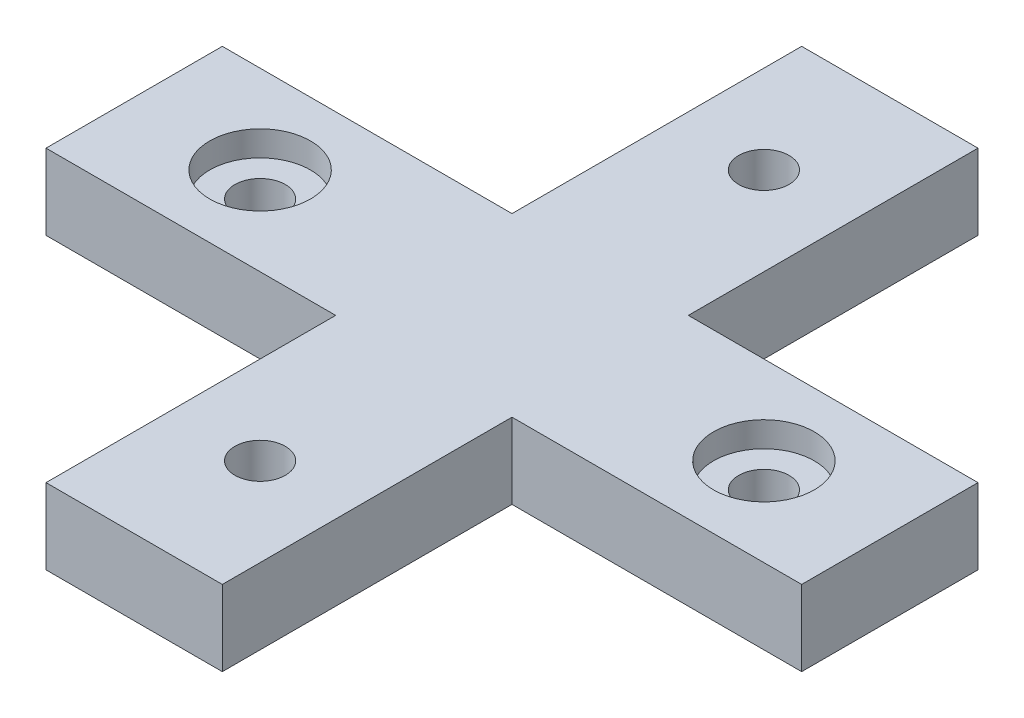
ISO-10303-21;
HEADER;
FILE_DESCRIPTION(('STEP AP214'),'2;1');
FILE_NAME('part.step','',(''),(''),'','','');
FILE_SCHEMA(('AUTOMOTIVE_DESIGN { 1 0 10303 214 1 1 1 1 }'));
ENDSEC;
DATA;
#1=APPLICATION_CONTEXT('core data for automotive mechanical design processes');
#2=APPLICATION_PROTOCOL_DEFINITION('international standard','automotive_design',2000,#1);
#3=PRODUCT_CONTEXT('',#1,'mechanical');
#4=PRODUCT('Part','Part','',(#3));
#5=PRODUCT_RELATED_PRODUCT_CATEGORY('part','',(#4));
#6=PRODUCT_DEFINITION_FORMATION('','',#4);
#7=PRODUCT_DEFINITION_CONTEXT('part definition',#1,'design');
#8=PRODUCT_DEFINITION('design','',#6,#7);
#9=PRODUCT_DEFINITION_SHAPE('','',#8);
#10=(LENGTH_UNIT() NAMED_UNIT(*) SI_UNIT(.MILLI.,.METRE.));
#11=(NAMED_UNIT(*) PLANE_ANGLE_UNIT() SI_UNIT($,.RADIAN.));
#12=(NAMED_UNIT(*) SI_UNIT($,.STERADIAN.) SOLID_ANGLE_UNIT());
#13=UNCERTAINTY_MEASURE_WITH_UNIT(LENGTH_MEASURE(1.E-05),#10,'distance_accuracy_value','');
#14=(GEOMETRIC_REPRESENTATION_CONTEXT(3) GLOBAL_UNCERTAINTY_ASSIGNED_CONTEXT((#13)) GLOBAL_UNIT_ASSIGNED_CONTEXT((#10,
#11,#12)) REPRESENTATION_CONTEXT('',''));
#15=CARTESIAN_POINT('',(0.,0.,0.));
#16=DIRECTION('',(0.,0.,1.));
#17=DIRECTION('',(1.,0.,0.));
#18=AXIS2_PLACEMENT_3D('',#15,#16,#17);
#19=CARTESIAN_POINT('',(0.,3.,3.5));
#20=DIRECTION('',(0.,0.,-1.));
#21=DIRECTION('',(-1.,0.,0.));
#22=AXIS2_PLACEMENT_3D('',#19,#20,#21);
#23=PLANE('',#22);
#24=DIRECTION('',(1.,0.,0.));
#25=VECTOR('',#24,1.);
#26=CARTESIAN_POINT('',(0.,0.,3.5));
#27=LINE('',#26,#25);
#28=CARTESIAN_POINT('',(-15.,0.,3.5));
#29=VERTEX_POINT('',#28);
#30=CARTESIAN_POINT('',(-3.5,0.,3.5));
#31=VERTEX_POINT('',#30);
#32=EDGE_CURVE('E164',#29,#31,#27,.T.);
#33=ORIENTED_EDGE('',*,*,#32,.T.);
#34=DIRECTION('',(0.,-1.,0.));
#35=VECTOR('',#34,1.);
#36=CARTESIAN_POINT('',(-3.5,3.,3.5));
#37=LINE('',#36,#35);
#38=CARTESIAN_POINT('',(-3.5,3.,3.5));
#39=VERTEX_POINT('',#38);
#40=EDGE_CURVE('E220',#39,#31,#37,.T.);
#41=ORIENTED_EDGE('',*,*,#40,.F.);
#42=DIRECTION('',(1.,0.,0.));
#43=VECTOR('',#42,1.);
#44=CARTESIAN_POINT('',(0.,3.,3.5));
#45=LINE('',#44,#43);
#46=CARTESIAN_POINT('',(-15.,3.,3.5));
#47=VERTEX_POINT('',#46);
#48=EDGE_CURVE('E233',#47,#39,#45,.T.);
#49=ORIENTED_EDGE('',*,*,#48,.F.);
#50=DIRECTION('',(0.,-1.,0.));
#51=VECTOR('',#50,1.);
#52=CARTESIAN_POINT('',(-15.,3.,3.5));
#53=LINE('',#52,#51);
#54=EDGE_CURVE('E163',#47,#29,#53,.T.);
#55=ORIENTED_EDGE('',*,*,#54,.T.);
#56=EDGE_LOOP('',(#33,#41,#49,#55));
#57=FACE_BOUND('',#56,.T.);
#58=ADVANCED_FACE('F33',(#57),#23,.F.);
#59=CARTESIAN_POINT('',(-3.5,3.,0.));
#60=DIRECTION('',(1.,0.,0.));
#61=DIRECTION('',(0.,0.,-1.));
#62=AXIS2_PLACEMENT_3D('',#59,#60,#61);
#63=PLANE('',#62);
#64=DIRECTION('',(0.,0.,1.));
#65=VECTOR('',#64,1.);
#66=CARTESIAN_POINT('',(-3.5,0.,0.));
#67=LINE('',#66,#65);
#68=CARTESIAN_POINT('',(-3.5,0.,15.));
#69=VERTEX_POINT('',#68);
#70=EDGE_CURVE('E167',#31,#69,#67,.T.);
#71=ORIENTED_EDGE('',*,*,#70,.T.);
#72=DIRECTION('',(0.,-1.,0.));
#73=VECTOR('',#72,1.);
#74=CARTESIAN_POINT('',(-3.5,3.,15.));
#75=LINE('',#74,#73);
#76=CARTESIAN_POINT('',(-3.5,3.,15.));
#77=VERTEX_POINT('',#76);
#78=EDGE_CURVE('E217',#77,#69,#75,.T.);
#79=ORIENTED_EDGE('',*,*,#78,.F.);
#80=DIRECTION('',(0.,0.,1.));
#81=VECTOR('',#80,1.);
#82=CARTESIAN_POINT('',(-3.5,3.,0.));
#83=LINE('',#82,#81);
#84=EDGE_CURVE('E102',#39,#77,#83,.T.);
#85=ORIENTED_EDGE('',*,*,#84,.F.);
#86=ORIENTED_EDGE('',*,*,#40,.T.);
#87=EDGE_LOOP('',(#71,#79,#85,#86));
#88=FACE_BOUND('',#87,.T.);
#89=ADVANCED_FACE('F279',(#88),#63,.F.);
#90=CARTESIAN_POINT('',(0.,3.,15.));
#91=DIRECTION('',(0.,0.,-1.));
#92=DIRECTION('',(-1.,0.,0.));
#93=AXIS2_PLACEMENT_3D('',#90,#91,#92);
#94=PLANE('',#93);
#95=DIRECTION('',(1.,0.,0.));
#96=VECTOR('',#95,1.);
#97=CARTESIAN_POINT('',(0.,0.,15.));
#98=LINE('',#97,#96);
#99=CARTESIAN_POINT('',(3.5,0.,15.));
#100=VERTEX_POINT('',#99);
#101=EDGE_CURVE('E170',#69,#100,#98,.T.);
#102=ORIENTED_EDGE('',*,*,#101,.T.);
#103=DIRECTION('',(0.,-1.,0.));
#104=VECTOR('',#103,1.);
#105=CARTESIAN_POINT('',(3.5,3.,15.));
#106=LINE('',#105,#104);
#107=CARTESIAN_POINT('',(3.5,3.,15.));
#108=VERTEX_POINT('',#107);
#109=EDGE_CURVE('E215',#108,#100,#106,.T.);
#110=ORIENTED_EDGE('',*,*,#109,.F.);
#111=DIRECTION('',(1.,0.,0.));
#112=VECTOR('',#111,1.);
#113=CARTESIAN_POINT('',(0.,3.,15.));
#114=LINE('',#113,#112);
#115=EDGE_CURVE('E241',#77,#108,#114,.T.);
#116=ORIENTED_EDGE('',*,*,#115,.F.);
#117=ORIENTED_EDGE('',*,*,#78,.T.);
#118=EDGE_LOOP('',(#102,#110,#116,#117));
#119=FACE_BOUND('',#118,.T.);
#120=ADVANCED_FACE('F283',(#119),#94,.F.);
#121=CARTESIAN_POINT('',(3.5,3.,0.));
#122=DIRECTION('',(1.,0.,0.));
#123=DIRECTION('',(0.,0.,-1.));
#124=AXIS2_PLACEMENT_3D('',#121,#122,#123);
#125=PLANE('',#124);
#126=DIRECTION('',(0.,0.,1.));
#127=VECTOR('',#126,1.);
#128=CARTESIAN_POINT('',(3.5,0.,0.));
#129=LINE('',#128,#127);
#130=CARTESIAN_POINT('',(3.5,0.,3.5));
#131=VERTEX_POINT('',#130);
#132=EDGE_CURVE('E173',#131,#100,#129,.T.);
#133=ORIENTED_EDGE('',*,*,#132,.F.);
#134=DIRECTION('',(0.,-1.,0.));
#135=VECTOR('',#134,1.);
#136=CARTESIAN_POINT('',(3.5,3.,3.5));
#137=LINE('',#136,#135);
#138=CARTESIAN_POINT('',(3.5,3.,3.5));
#139=VERTEX_POINT('',#138);
#140=EDGE_CURVE('E213',#139,#131,#137,.T.);
#141=ORIENTED_EDGE('',*,*,#140,.F.);
#142=DIRECTION('',(0.,0.,1.));
#143=VECTOR('',#142,1.);
#144=CARTESIAN_POINT('',(3.5,3.,0.));
#145=LINE('',#144,#143);
#146=EDGE_CURVE('E243',#139,#108,#145,.T.);
#147=ORIENTED_EDGE('',*,*,#146,.T.);
#148=ORIENTED_EDGE('',*,*,#109,.T.);
#149=EDGE_LOOP('',(#133,#141,#147,#148));
#150=FACE_BOUND('',#149,.T.);
#151=ADVANCED_FACE('F288',(#150),#125,.T.);
#152=CARTESIAN_POINT('',(0.,3.,3.5));
#153=DIRECTION('',(0.,0.,-1.));
#154=DIRECTION('',(-1.,0.,0.));
#155=AXIS2_PLACEMENT_3D('',#152,#153,#154);
#156=PLANE('',#155);
#157=DIRECTION('',(1.,0.,0.));
#158=VECTOR('',#157,1.);
#159=CARTESIAN_POINT('',(0.,0.,3.5));
#160=LINE('',#159,#158);
#161=CARTESIAN_POINT('',(15.,0.,3.5));
#162=VERTEX_POINT('',#161);
#163=EDGE_CURVE('E176',#131,#162,#160,.T.);
#164=ORIENTED_EDGE('',*,*,#163,.T.);
#165=DIRECTION('',(0.,-1.,0.));
#166=VECTOR('',#165,1.);
#167=CARTESIAN_POINT('',(15.,3.,3.5));
#168=LINE('',#167,#166);
#169=CARTESIAN_POINT('',(15.,3.,3.5));
#170=VERTEX_POINT('',#169);
#171=EDGE_CURVE('E211',#170,#162,#168,.T.);
#172=ORIENTED_EDGE('',*,*,#171,.F.);
#173=DIRECTION('',(1.,0.,0.));
#174=VECTOR('',#173,1.);
#175=CARTESIAN_POINT('',(0.,3.,3.5));
#176=LINE('',#175,#174);
#177=EDGE_CURVE('E246',#139,#170,#176,.T.);
#178=ORIENTED_EDGE('',*,*,#177,.F.);
#179=ORIENTED_EDGE('',*,*,#140,.T.);
#180=EDGE_LOOP('',(#164,#172,#178,#179));
#181=FACE_BOUND('',#180,.T.);
#182=ADVANCED_FACE('F292',(#181),#156,.F.);
#183=CARTESIAN_POINT('',(15.,3.,0.));
#184=DIRECTION('',(1.,0.,0.));
#185=DIRECTION('',(0.,0.,-1.));
#186=AXIS2_PLACEMENT_3D('',#183,#184,#185);
#187=PLANE('',#186);
#188=DIRECTION('',(0.,0.,1.));
#189=VECTOR('',#188,1.);
#190=CARTESIAN_POINT('',(15.,0.,0.));
#191=LINE('',#190,#189);
#192=CARTESIAN_POINT('',(15.,0.,-3.5));
#193=VERTEX_POINT('',#192);
#194=EDGE_CURVE('E179',#193,#162,#191,.T.);
#195=ORIENTED_EDGE('',*,*,#194,.F.);
#196=DIRECTION('',(0.,-1.,0.));
#197=VECTOR('',#196,1.);
#198=CARTESIAN_POINT('',(15.,3.,-3.5));
#199=LINE('',#198,#197);
#200=CARTESIAN_POINT('',(15.,3.,-3.5));
#201=VERTEX_POINT('',#200);
#202=EDGE_CURVE('E209',#201,#193,#199,.T.);
#203=ORIENTED_EDGE('',*,*,#202,.F.);
#204=DIRECTION('',(0.,0.,1.));
#205=VECTOR('',#204,1.);
#206=CARTESIAN_POINT('',(15.,3.,0.));
#207=LINE('',#206,#205);
#208=EDGE_CURVE('E248',#201,#170,#207,.T.);
#209=ORIENTED_EDGE('',*,*,#208,.T.);
#210=ORIENTED_EDGE('',*,*,#171,.T.);
#211=EDGE_LOOP('',(#195,#203,#209,#210));
#212=FACE_BOUND('',#211,.T.);
#213=ADVANCED_FACE('F296',(#212),#187,.T.);
#214=CARTESIAN_POINT('',(0.,3.,-3.5));
#215=DIRECTION('',(0.,0.,-1.));
#216=DIRECTION('',(-1.,0.,0.));
#217=AXIS2_PLACEMENT_3D('',#214,#215,#216);
#218=PLANE('',#217);
#219=DIRECTION('',(1.,0.,0.));
#220=VECTOR('',#219,1.);
#221=CARTESIAN_POINT('',(0.,0.,-3.5));
#222=LINE('',#221,#220);
#223=CARTESIAN_POINT('',(3.5,0.,-3.5));
#224=VERTEX_POINT('',#223);
#225=EDGE_CURVE('E182',#224,#193,#222,.T.);
#226=ORIENTED_EDGE('',*,*,#225,.F.);
#227=DIRECTION('',(0.,-1.,0.));
#228=VECTOR('',#227,1.);
#229=CARTESIAN_POINT('',(3.5,3.,-3.5));
#230=LINE('',#229,#228);
#231=CARTESIAN_POINT('',(3.5,3.,-3.5));
#232=VERTEX_POINT('',#231);
#233=EDGE_CURVE('E207',#232,#224,#230,.T.);
#234=ORIENTED_EDGE('',*,*,#233,.F.);
#235=DIRECTION('',(1.,0.,0.));
#236=VECTOR('',#235,1.);
#237=CARTESIAN_POINT('',(0.,3.,-3.5));
#238=LINE('',#237,#236);
#239=EDGE_CURVE('E251',#232,#201,#238,.T.);
#240=ORIENTED_EDGE('',*,*,#239,.T.);
#241=ORIENTED_EDGE('',*,*,#202,.T.);
#242=EDGE_LOOP('',(#226,#234,#240,#241));
#243=FACE_BOUND('',#242,.T.);
#244=ADVANCED_FACE('F300',(#243),#218,.T.);
#245=CARTESIAN_POINT('',(3.5,3.,0.));
#246=DIRECTION('',(1.,0.,0.));
#247=DIRECTION('',(0.,0.,-1.));
#248=AXIS2_PLACEMENT_3D('',#245,#246,#247);
#249=PLANE('',#248);
#250=DIRECTION('',(0.,0.,1.));
#251=VECTOR('',#250,1.);
#252=CARTESIAN_POINT('',(3.5,0.,0.));
#253=LINE('',#252,#251);
#254=CARTESIAN_POINT('',(3.5,0.,-15.));
#255=VERTEX_POINT('',#254);
#256=EDGE_CURVE('E185',#255,#224,#253,.T.);
#257=ORIENTED_EDGE('',*,*,#256,.F.);
#258=DIRECTION('',(0.,-1.,0.));
#259=VECTOR('',#258,1.);
#260=CARTESIAN_POINT('',(3.5,3.,-15.));
#261=LINE('',#260,#259);
#262=CARTESIAN_POINT('',(3.5,3.,-15.));
#263=VERTEX_POINT('',#262);
#264=EDGE_CURVE('E205',#263,#255,#261,.T.);
#265=ORIENTED_EDGE('',*,*,#264,.F.);
#266=DIRECTION('',(0.,0.,1.));
#267=VECTOR('',#266,1.);
#268=CARTESIAN_POINT('',(3.5,3.,0.));
#269=LINE('',#268,#267);
#270=EDGE_CURVE('E254',#263,#232,#269,.T.);
#271=ORIENTED_EDGE('',*,*,#270,.T.);
#272=ORIENTED_EDGE('',*,*,#233,.T.);
#273=EDGE_LOOP('',(#257,#265,#271,#272));
#274=FACE_BOUND('',#273,.T.);
#275=ADVANCED_FACE('F304',(#274),#249,.T.);
#276=CARTESIAN_POINT('',(0.,3.,-15.));
#277=DIRECTION('',(0.,0.,-1.));
#278=DIRECTION('',(-1.,0.,0.));
#279=AXIS2_PLACEMENT_3D('',#276,#277,#278);
#280=PLANE('',#279);
#281=DIRECTION('',(1.,0.,0.));
#282=VECTOR('',#281,1.);
#283=CARTESIAN_POINT('',(0.,0.,-15.));
#284=LINE('',#283,#282);
#285=CARTESIAN_POINT('',(-3.5,0.,-15.));
#286=VERTEX_POINT('',#285);
#287=EDGE_CURVE('E188',#286,#255,#284,.T.);
#288=ORIENTED_EDGE('',*,*,#287,.F.);
#289=DIRECTION('',(0.,-1.,0.));
#290=VECTOR('',#289,1.);
#291=CARTESIAN_POINT('',(-3.5,3.,-15.));
#292=LINE('',#291,#290);
#293=CARTESIAN_POINT('',(-3.5,3.,-15.));
#294=VERTEX_POINT('',#293);
#295=EDGE_CURVE('E147',#294,#286,#292,.T.);
#296=ORIENTED_EDGE('',*,*,#295,.F.);
#297=DIRECTION('',(1.,0.,0.));
#298=VECTOR('',#297,1.);
#299=CARTESIAN_POINT('',(0.,3.,-15.));
#300=LINE('',#299,#298);
#301=EDGE_CURVE('E136',#294,#263,#300,.T.);
#302=ORIENTED_EDGE('',*,*,#301,.T.);
#303=ORIENTED_EDGE('',*,*,#264,.T.);
#304=EDGE_LOOP('',(#288,#296,#302,#303));
#305=FACE_BOUND('',#304,.T.);
#306=ADVANCED_FACE('F258',(#305),#280,.T.);
#307=CARTESIAN_POINT('',(-3.5,3.,0.));
#308=DIRECTION('',(1.,0.,0.));
#309=DIRECTION('',(0.,0.,-1.));
#310=AXIS2_PLACEMENT_3D('',#307,#308,#309);
#311=PLANE('',#310);
#312=DIRECTION('',(0.,0.,1.));
#313=VECTOR('',#312,1.);
#314=CARTESIAN_POINT('',(-3.5,0.,0.));
#315=LINE('',#314,#313);
#316=CARTESIAN_POINT('',(-3.5,0.,-3.5));
#317=VERTEX_POINT('',#316);
#318=EDGE_CURVE('E143',#286,#317,#315,.T.);
#319=ORIENTED_EDGE('',*,*,#318,.T.);
#320=DIRECTION('',(0.,-1.,0.));
#321=VECTOR('',#320,1.);
#322=CARTESIAN_POINT('',(-3.5,3.,-3.5));
#323=LINE('',#322,#321);
#324=CARTESIAN_POINT('',(-3.5,3.,-3.5));
#325=VERTEX_POINT('',#324);
#326=EDGE_CURVE('E140',#325,#317,#323,.T.);
#327=ORIENTED_EDGE('',*,*,#326,.F.);
#328=DIRECTION('',(0.,0.,1.));
#329=VECTOR('',#328,1.);
#330=CARTESIAN_POINT('',(-3.5,3.,0.));
#331=LINE('',#330,#329);
#332=EDGE_CURVE('E128',#294,#325,#331,.T.);
#333=ORIENTED_EDGE('',*,*,#332,.F.);
#334=ORIENTED_EDGE('',*,*,#295,.T.);
#335=EDGE_LOOP('',(#319,#327,#333,#334));
#336=FACE_BOUND('',#335,.T.);
#337=ADVANCED_FACE('F141',(#336),#311,.F.);
#338=CARTESIAN_POINT('',(0.,3.,-3.5));
#339=DIRECTION('',(0.,0.,-1.));
#340=DIRECTION('',(-1.,0.,0.));
#341=AXIS2_PLACEMENT_3D('',#338,#339,#340);
#342=PLANE('',#341);
#343=DIRECTION('',(1.,0.,0.));
#344=VECTOR('',#343,1.);
#345=CARTESIAN_POINT('',(0.,0.,-3.5));
#346=LINE('',#345,#344);
#347=CARTESIAN_POINT('',(-15.,0.,-3.5));
#348=VERTEX_POINT('',#347);
#349=EDGE_CURVE('E192',#348,#317,#346,.T.);
#350=ORIENTED_EDGE('',*,*,#349,.F.);
#351=DIRECTION('',(0.,-1.,0.));
#352=VECTOR('',#351,1.);
#353=CARTESIAN_POINT('',(-15.,3.,-3.5));
#354=LINE('',#353,#352);
#355=CARTESIAN_POINT('',(-15.,3.,-3.5));
#356=VERTEX_POINT('',#355);
#357=EDGE_CURVE('E90',#356,#348,#354,.T.);
#358=ORIENTED_EDGE('',*,*,#357,.F.);
#359=DIRECTION('',(1.,0.,0.));
#360=VECTOR('',#359,1.);
#361=CARTESIAN_POINT('',(0.,3.,-3.5));
#362=LINE('',#361,#360);
#363=EDGE_CURVE('E133',#356,#325,#362,.T.);
#364=ORIENTED_EDGE('',*,*,#363,.T.);
#365=ORIENTED_EDGE('',*,*,#326,.T.);
#366=EDGE_LOOP('',(#350,#358,#364,#365));
#367=FACE_BOUND('',#366,.T.);
#368=ADVANCED_FACE('F149',(#367),#342,.T.);
#369=CARTESIAN_POINT('',(1.04744440165294E-13,3.,10.));
#370=DIRECTION('',(0.,-1.,0.));
#371=DIRECTION('',(0.,0.,-1.));
#372=AXIS2_PLACEMENT_3D('',#369,#370,#371);
#373=CYLINDRICAL_SURFACE('',#372,1.);
#374=CARTESIAN_POINT('',(1.04744440165294E-13,3.,10.));
#375=DIRECTION('',(0.,1.,0.));
#376=DIRECTION('',(0.,0.,1.));
#377=AXIS2_PLACEMENT_3D('',#374,#375,#376);
#378=CIRCLE('',#377,1.);
#379=CARTESIAN_POINT('',(1.04744440165294E-13,3.,11.));
#380=VERTEX_POINT('',#379);
#381=EDGE_CURVE('E157',#380,#380,#378,.T.);
#382=ORIENTED_EDGE('',*,*,#381,.T.);
#383=EDGE_LOOP('',(#382));
#384=FACE_BOUND('',#383,.T.);
#385=CARTESIAN_POINT('',(1.04744440165294E-13,0.,10.));
#386=DIRECTION('',(0.,1.,0.));
#387=DIRECTION('',(0.,0.,1.));
#388=AXIS2_PLACEMENT_3D('',#385,#386,#387);
#389=CIRCLE('',#388,1.);
#390=CARTESIAN_POINT('',(1.04744440165294E-13,0.,11.));
#391=VERTEX_POINT('',#390);
#392=EDGE_CURVE('E195',#391,#391,#389,.T.);
#393=ORIENTED_EDGE('',*,*,#392,.F.);
#394=EDGE_LOOP('',(#393));
#395=FACE_BOUND('',#394,.T.);
#396=ADVANCED_FACE('F274',(#384,#395),#373,.F.);
#397=CARTESIAN_POINT('',(10.,3.,0.));
#398=DIRECTION('',(0.,-1.,0.));
#399=DIRECTION('',(0.,0.,-1.));
#400=AXIS2_PLACEMENT_3D('',#397,#398,#399);
#401=CYLINDRICAL_SURFACE('',#400,2.);
#402=CARTESIAN_POINT('',(10.,2.,0.));
#403=DIRECTION('',(0.,1.,0.));
#404=DIRECTION('',(0.,0.,1.));
#405=AXIS2_PLACEMENT_3D('',#402,#403,#404);
#406=CIRCLE('',#405,2.);
#407=CARTESIAN_POINT('',(10.,2.,2.));
#408=VERTEX_POINT('',#407);
#409=EDGE_CURVE('E11',#408,#408,#406,.T.);
#410=ORIENTED_EDGE('',*,*,#409,.F.);
#411=EDGE_LOOP('',(#410));
#412=FACE_BOUND('',#411,.T.);
#413=CARTESIAN_POINT('',(10.,3.,0.));
#414=DIRECTION('',(0.,1.,0.));
#415=DIRECTION('',(0.,0.,1.));
#416=AXIS2_PLACEMENT_3D('',#413,#414,#415);
#417=CIRCLE('',#416,2.);
#418=CARTESIAN_POINT('',(10.,3.,2.));
#419=VERTEX_POINT('',#418);
#420=EDGE_CURVE('E151',#419,#419,#417,.T.);
#421=ORIENTED_EDGE('',*,*,#420,.T.);
#422=EDGE_LOOP('',(#421));
#423=FACE_BOUND('',#422,.T.);
#424=ADVANCED_FACE('F269',(#412,#423),#401,.F.);
#425=CARTESIAN_POINT('',(-15.,3.,0.));
#426=DIRECTION('',(1.,0.,0.));
#427=DIRECTION('',(0.,0.,-1.));
#428=AXIS2_PLACEMENT_3D('',#425,#426,#427);
#429=PLANE('',#428);
#430=DIRECTION('',(0.,0.,1.));
#431=VECTOR('',#430,1.);
#432=CARTESIAN_POINT('',(-15.,0.,0.));
#433=LINE('',#432,#431);
#434=EDGE_CURVE('E93',#348,#29,#433,.T.);
#435=ORIENTED_EDGE('',*,*,#434,.T.);
#436=ORIENTED_EDGE('',*,*,#54,.F.);
#437=DIRECTION('',(0.,0.,1.));
#438=VECTOR('',#437,1.);
#439=CARTESIAN_POINT('',(-15.,3.,0.));
#440=LINE('',#439,#438);
#441=EDGE_CURVE('E50',#356,#47,#440,.T.);
#442=ORIENTED_EDGE('',*,*,#441,.F.);
#443=ORIENTED_EDGE('',*,*,#357,.T.);
#444=EDGE_LOOP('',(#435,#436,#442,#443));
#445=FACE_BOUND('',#444,.T.);
#446=ADVANCED_FACE('F229',(#445),#429,.F.);
#447=CARTESIAN_POINT('',(-10.,3.,0.));
#448=DIRECTION('',(0.,-1.,0.));
#449=DIRECTION('',(0.,0.,-1.));
#450=AXIS2_PLACEMENT_3D('',#447,#448,#449);
#451=CYLINDRICAL_SURFACE('',#450,2.);
#452=CARTESIAN_POINT('',(-10.,2.,0.));
#453=DIRECTION('',(0.,1.,0.));
#454=DIRECTION('',(0.,0.,1.));
#455=AXIS2_PLACEMENT_3D('',#452,#453,#454);
#456=CIRCLE('',#455,2.);
#457=CARTESIAN_POINT('',(-10.,2.,2.00000000000007));
#458=VERTEX_POINT('',#457);
#459=EDGE_CURVE('E42',#458,#458,#456,.T.);
#460=ORIENTED_EDGE('',*,*,#459,.F.);
#461=EDGE_LOOP('',(#460));
#462=FACE_BOUND('',#461,.T.);
#463=CARTESIAN_POINT('',(-10.,3.,0.));
#464=DIRECTION('',(0.,1.,0.));
#465=DIRECTION('',(0.,0.,1.));
#466=AXIS2_PLACEMENT_3D('',#463,#464,#465);
#467=CIRCLE('',#466,2.);
#468=CARTESIAN_POINT('',(-10.,3.,2.00000000000007));
#469=VERTEX_POINT('',#468);
#470=EDGE_CURVE('E201',#469,#469,#467,.T.);
#471=ORIENTED_EDGE('',*,*,#470,.T.);
#472=EDGE_LOOP('',(#471));
#473=FACE_BOUND('',#472,.T.);
#474=ADVANCED_FACE('F35',(#462,#473),#451,.F.);
#475=CARTESIAN_POINT('',(0.,3.,-10.));
#476=DIRECTION('',(0.,-1.,0.));
#477=DIRECTION('',(0.,0.,-1.));
#478=AXIS2_PLACEMENT_3D('',#475,#476,#477);
#479=CYLINDRICAL_SURFACE('',#478,1.);
#480=CARTESIAN_POINT('',(0.,3.,-10.));
#481=DIRECTION('',(0.,1.,0.));
#482=DIRECTION('',(0.,0.,1.));
#483=AXIS2_PLACEMENT_3D('',#480,#481,#482);
#484=CIRCLE('',#483,1.);
#485=CARTESIAN_POINT('',(0.,3.,-9.));
#486=VERTEX_POINT('',#485);
#487=EDGE_CURVE('E160',#486,#486,#484,.T.);
#488=ORIENTED_EDGE('',*,*,#487,.T.);
#489=EDGE_LOOP('',(#488));
#490=FACE_BOUND('',#489,.T.);
#491=CARTESIAN_POINT('',(0.,0.,-10.));
#492=DIRECTION('',(0.,1.,0.));
#493=DIRECTION('',(0.,0.,1.));
#494=AXIS2_PLACEMENT_3D('',#491,#492,#493);
#495=CIRCLE('',#494,1.);
#496=CARTESIAN_POINT('',(0.,0.,-9.));
#497=VERTEX_POINT('',#496);
#498=EDGE_CURVE('E198',#497,#497,#495,.T.);
#499=ORIENTED_EDGE('',*,*,#498,.F.);
#500=EDGE_LOOP('',(#499));
#501=FACE_BOUND('',#500,.T.);
#502=ADVANCED_FACE('F228',(#490,#501),#479,.F.);
#503=CARTESIAN_POINT('',(0.,3.,0.));
#504=DIRECTION('',(0.,1.,0.));
#505=DIRECTION('',(0.,0.,1.));
#506=AXIS2_PLACEMENT_3D('',#503,#504,#505);
#507=PLANE('',#506);
#508=ORIENTED_EDGE('',*,*,#470,.F.);
#509=EDGE_LOOP('',(#508));
#510=FACE_BOUND('',#509,.T.);
#511=ORIENTED_EDGE('',*,*,#48,.T.);
#512=ORIENTED_EDGE('',*,*,#84,.T.);
#513=ORIENTED_EDGE('',*,*,#115,.T.);
#514=ORIENTED_EDGE('',*,*,#146,.F.);
#515=ORIENTED_EDGE('',*,*,#177,.T.);
#516=ORIENTED_EDGE('',*,*,#208,.F.);
#517=ORIENTED_EDGE('',*,*,#239,.F.);
#518=ORIENTED_EDGE('',*,*,#270,.F.);
#519=ORIENTED_EDGE('',*,*,#301,.F.);
#520=ORIENTED_EDGE('',*,*,#332,.T.);
#521=ORIENTED_EDGE('',*,*,#363,.F.);
#522=ORIENTED_EDGE('',*,*,#441,.T.);
#523=EDGE_LOOP('',(#511,#512,#513,#514,#515,#516,#517,#518,#519,#520,#521,#522));
#524=FACE_BOUND('',#523,.T.);
#525=ORIENTED_EDGE('',*,*,#420,.F.);
#526=EDGE_LOOP('',(#525));
#527=FACE_BOUND('',#526,.T.);
#528=ORIENTED_EDGE('',*,*,#381,.F.);
#529=EDGE_LOOP('',(#528));
#530=FACE_BOUND('',#529,.T.);
#531=ORIENTED_EDGE('',*,*,#487,.F.);
#532=EDGE_LOOP('',(#531));
#533=FACE_BOUND('',#532,.T.);
#534=ADVANCED_FACE('F130',(#510,#524,#527,#530,#533),#507,.T.);
#535=CARTESIAN_POINT('',(0.,0.,0.));
#536=DIRECTION('',(0.,1.,0.));
#537=DIRECTION('',(0.,0.,1.));
#538=AXIS2_PLACEMENT_3D('',#535,#536,#537);
#539=PLANE('',#538);
#540=ORIENTED_EDGE('',*,*,#32,.F.);
#541=ORIENTED_EDGE('',*,*,#434,.F.);
#542=ORIENTED_EDGE('',*,*,#349,.T.);
#543=ORIENTED_EDGE('',*,*,#318,.F.);
#544=ORIENTED_EDGE('',*,*,#287,.T.);
#545=ORIENTED_EDGE('',*,*,#256,.T.);
#546=ORIENTED_EDGE('',*,*,#225,.T.);
#547=ORIENTED_EDGE('',*,*,#194,.T.);
#548=ORIENTED_EDGE('',*,*,#163,.F.);
#549=ORIENTED_EDGE('',*,*,#132,.T.);
#550=ORIENTED_EDGE('',*,*,#101,.F.);
#551=ORIENTED_EDGE('',*,*,#70,.F.);
#552=EDGE_LOOP('',(#540,#541,#542,#543,#544,#545,#546,#547,#548,#549,#550,#551));
#553=FACE_BOUND('',#552,.T.);
#554=ORIENTED_EDGE('',*,*,#392,.T.);
#555=EDGE_LOOP('',(#554));
#556=FACE_BOUND('',#555,.T.);
#557=ORIENTED_EDGE('',*,*,#498,.T.);
#558=EDGE_LOOP('',(#557));
#559=FACE_BOUND('',#558,.T.);
#560=CARTESIAN_POINT('',(-10.,0.,0.));
#561=DIRECTION('',(0.,1.,0.));
#562=DIRECTION('',(0.,0.,1.));
#563=AXIS2_PLACEMENT_3D('',#560,#561,#562);
#564=CIRCLE('',#563,1.);
#565=CARTESIAN_POINT('',(-10.,0.,1.00000000000007));
#566=VERTEX_POINT('',#565);
#567=EDGE_CURVE('E237',#566,#566,#564,.T.);
#568=ORIENTED_EDGE('',*,*,#567,.T.);
#569=EDGE_LOOP('',(#568));
#570=FACE_BOUND('',#569,.T.);
#571=CARTESIAN_POINT('',(10.,0.,0.));
#572=DIRECTION('',(0.,1.,0.));
#573=DIRECTION('',(0.,0.,1.));
#574=AXIS2_PLACEMENT_3D('',#571,#572,#573);
#575=CIRCLE('',#574,1.);
#576=CARTESIAN_POINT('',(10.,0.,1.));
#577=VERTEX_POINT('',#576);
#578=EDGE_CURVE('E365',#577,#577,#575,.T.);
#579=ORIENTED_EDGE('',*,*,#578,.T.);
#580=EDGE_LOOP('',(#579));
#581=FACE_BOUND('',#580,.T.);
#582=ADVANCED_FACE('F262',(#553,#556,#559,#570,#581),#539,.F.);
#583=CARTESIAN_POINT('',(-10.,2.,0.));
#584=DIRECTION('',(0.,-1.,0.));
#585=DIRECTION('',(0.,0.,-1.));
#586=AXIS2_PLACEMENT_3D('',#583,#584,#585);
#587=CYLINDRICAL_SURFACE('',#586,1.);
#588=CARTESIAN_POINT('',(-10.,2.,0.));
#589=DIRECTION('',(0.,1.,0.));
#590=DIRECTION('',(0.,0.,1.));
#591=AXIS2_PLACEMENT_3D('',#588,#589,#590);
#592=CIRCLE('',#591,1.);
#593=CARTESIAN_POINT('',(-10.,2.,1.00000000000007));
#594=VERTEX_POINT('',#593);
#595=EDGE_CURVE('E168',#594,#594,#592,.T.);
#596=ORIENTED_EDGE('',*,*,#595,.T.);
#597=EDGE_LOOP('',(#596));
#598=FACE_BOUND('',#597,.T.);
#599=ORIENTED_EDGE('',*,*,#567,.F.);
#600=EDGE_LOOP('',(#599));
#601=FACE_BOUND('',#600,.T.);
#602=ADVANCED_FACE('F327',(#598,#601),#587,.F.);
#603=CARTESIAN_POINT('',(0.,2.,0.));
#604=DIRECTION('',(0.,1.,0.));
#605=DIRECTION('',(0.,0.,1.));
#606=AXIS2_PLACEMENT_3D('',#603,#604,#605);
#607=PLANE('',#606);
#608=ORIENTED_EDGE('',*,*,#595,.F.);
#609=EDGE_LOOP('',(#608));
#610=FACE_BOUND('',#609,.T.);
#611=ORIENTED_EDGE('',*,*,#459,.T.);
#612=EDGE_LOOP('',(#611));
#613=FACE_BOUND('',#612,.T.);
#614=ADVANCED_FACE('F224',(#610,#613),#607,.T.);
#615=CARTESIAN_POINT('',(10.,2.,0.));
#616=DIRECTION('',(0.,-1.,0.));
#617=DIRECTION('',(0.,0.,-1.));
#618=AXIS2_PLACEMENT_3D('',#615,#616,#617);
#619=CYLINDRICAL_SURFACE('',#618,1.);
#620=CARTESIAN_POINT('',(10.,2.,0.));
#621=DIRECTION('',(0.,1.,0.));
#622=DIRECTION('',(0.,0.,1.));
#623=AXIS2_PLACEMENT_3D('',#620,#621,#622);
#624=CIRCLE('',#623,1.);
#625=CARTESIAN_POINT('',(10.,2.,1.));
#626=VERTEX_POINT('',#625);
#627=EDGE_CURVE('E348',#626,#626,#624,.T.);
#628=ORIENTED_EDGE('',*,*,#627,.T.);
#629=EDGE_LOOP('',(#628));
#630=FACE_BOUND('',#629,.T.);
#631=ORIENTED_EDGE('',*,*,#578,.F.);
#632=EDGE_LOOP('',(#631));
#633=FACE_BOUND('',#632,.T.);
#634=ADVANCED_FACE('F335',(#630,#633),#619,.F.);
#635=CARTESIAN_POINT('',(0.,2.,0.));
#636=DIRECTION('',(0.,1.,0.));
#637=DIRECTION('',(0.,0.,1.));
#638=AXIS2_PLACEMENT_3D('',#635,#636,#637);
#639=PLANE('',#638);
#640=ORIENTED_EDGE('',*,*,#627,.F.);
#641=EDGE_LOOP('',(#640));
#642=FACE_BOUND('',#641,.T.);
#643=ORIENTED_EDGE('',*,*,#409,.T.);
#644=EDGE_LOOP('',(#643));
#645=FACE_BOUND('',#644,.T.);
#646=ADVANCED_FACE('F339',(#642,#645),#639,.T.);
#647=CLOSED_SHELL('',(#58,#89,#120,#151,#182,#213,#244,#275,#306,#337,#368,#396,#424,#446,#474,
#502,#534,#582,#602,#614,#634,#646));
#648=MANIFOLD_SOLID_BREP('B2',#647);
#649=ADVANCED_BREP_SHAPE_REPRESENTATION('',(#18,#648),#14);
#650=SHAPE_DEFINITION_REPRESENTATION(#9,#649);
ENDSEC;
END-ISO-10303-21;
